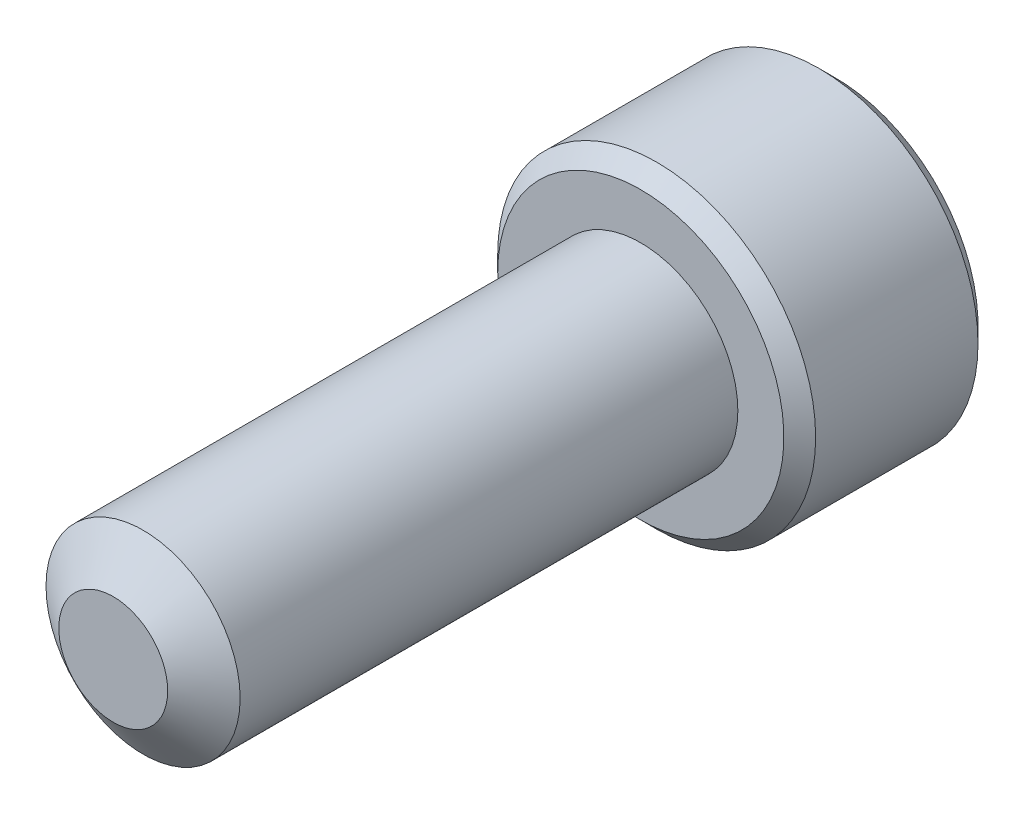
ISO-10303-21;
HEADER;
FILE_DESCRIPTION(('STEP AP214'),'2;1');
FILE_NAME('part.step','',(''),(''),'','','');
FILE_SCHEMA(('AUTOMOTIVE_DESIGN { 1 0 10303 214 1 1 1 1 }'));
ENDSEC;
DATA;
#1=APPLICATION_CONTEXT('core data for automotive mechanical design processes');
#2=APPLICATION_PROTOCOL_DEFINITION('international standard','automotive_design',2000,#1);
#3=PRODUCT_CONTEXT('',#1,'mechanical');
#4=PRODUCT('Part','Part','',(#3));
#5=PRODUCT_RELATED_PRODUCT_CATEGORY('part','',(#4));
#6=PRODUCT_DEFINITION_FORMATION('','',#4);
#7=PRODUCT_DEFINITION_CONTEXT('part definition',#1,'design');
#8=PRODUCT_DEFINITION('design','',#6,#7);
#9=PRODUCT_DEFINITION_SHAPE('','',#8);
#10=(LENGTH_UNIT() NAMED_UNIT(*) SI_UNIT(.MILLI.,.METRE.));
#11=(NAMED_UNIT(*) PLANE_ANGLE_UNIT() SI_UNIT($,.RADIAN.));
#12=(NAMED_UNIT(*) SI_UNIT($,.STERADIAN.) SOLID_ANGLE_UNIT());
#13=UNCERTAINTY_MEASURE_WITH_UNIT(LENGTH_MEASURE(1.E-05),#10,'distance_accuracy_value','');
#14=(GEOMETRIC_REPRESENTATION_CONTEXT(3) GLOBAL_UNCERTAINTY_ASSIGNED_CONTEXT((#13)) GLOBAL_UNIT_ASSIGNED_CONTEXT((#10,
#11,#12)) REPRESENTATION_CONTEXT('',''));
#15=CARTESIAN_POINT('',(0.,0.,0.));
#16=DIRECTION('',(0.,0.,1.));
#17=DIRECTION('',(1.,0.,0.));
#18=AXIS2_PLACEMENT_3D('',#15,#16,#17);
#19=CARTESIAN_POINT('',(0.,0.,-9.525));
#20=DIRECTION('',(0.,0.,1.));
#21=DIRECTION('',(1.,0.,0.));
#22=AXIS2_PLACEMENT_3D('',#19,#20,#21);
#23=CYLINDRICAL_SURFACE('',#22,1.7526);
#24=CARTESIAN_POINT('',(0.,0.,-9.525));
#25=DIRECTION('',(0.,0.,-1.));
#26=DIRECTION('',(-1.,0.,0.));
#27=AXIS2_PLACEMENT_3D('',#24,#25,#26);
#28=CIRCLE('',#27,1.7526);
#29=CARTESIAN_POINT('',(1.7526,0.,-9.525));
#30=VERTEX_POINT('',#29);
#31=EDGE_CURVE('E214',#30,#30,#28,.F.);
#32=CARTESIAN_POINT('',(0.,0.,-0.538848735955547));
#33=DIRECTION('',(0.,0.,1.));
#34=DIRECTION('',(1.,0.,0.));
#35=AXIS2_PLACEMENT_3D('',#32,#33,#34);
#36=CIRCLE('',#35,1.7526);
#37=CARTESIAN_POINT('',(1.7526,0.,-0.538848735955548));
#38=VERTEX_POINT('',#37);
#39=EDGE_CURVE('E108',#38,#38,#36,.T.);
#40=CARTESIAN_POINT('',(1.7526,0.,-9.525));
#41=CARTESIAN_POINT('',(1.7526,0.,-9.4313942576662));
#42=CARTESIAN_POINT('',(1.7526,0.,-9.33778851533241));
#43=CARTESIAN_POINT('',(1.7526,0.,-9.15057703066481));
#44=CARTESIAN_POINT('',(1.7526,0.,-9.05697128833102));
#45=CARTESIAN_POINT('',(1.7526,0.,-8.86975980366342));
#46=CARTESIAN_POINT('',(1.7526,0.,-8.77615406132963));
#47=CARTESIAN_POINT('',(1.7526,0.,-8.58894257666203));
#48=CARTESIAN_POINT('',(1.7526,0.,-8.49533683432824));
#49=CARTESIAN_POINT('',(1.7526,0.,-8.30812534966065));
#50=CARTESIAN_POINT('',(1.7526,0.,-8.21451960732685));
#51=CARTESIAN_POINT('',(1.7526,0.,-8.02730812265926));
#52=CARTESIAN_POINT('',(1.7526,0.,-7.93370238032546));
#53=CARTESIAN_POINT('',(1.7526,0.,-7.74649089565787));
#54=CARTESIAN_POINT('',(1.7526,0.,-7.65288515332407));
#55=CARTESIAN_POINT('',(1.7526,0.,-7.46567366865648));
#56=CARTESIAN_POINT('',(1.7526,0.,-7.37206792632268));
#57=CARTESIAN_POINT('',(1.7526,0.,-7.18485644165509));
#58=CARTESIAN_POINT('',(1.7526,0.,-7.09125069932129));
#59=CARTESIAN_POINT('',(1.7526,0.,-6.9040392146537));
#60=CARTESIAN_POINT('',(1.7526,0.,-6.8104334723199));
#61=CARTESIAN_POINT('',(1.7526,0.,-6.62322198765231));
#62=CARTESIAN_POINT('',(1.7526,0.,-6.52961624531851));
#63=CARTESIAN_POINT('',(1.7526,0.,-6.34240476065092));
#64=CARTESIAN_POINT('',(1.7526,0.,-6.24879901831713));
#65=CARTESIAN_POINT('',(1.7526,0.,-6.06158753364953));
#66=CARTESIAN_POINT('',(1.7526,0.,-5.96798179131574));
#67=CARTESIAN_POINT('',(1.7526,0.,-5.78077030664814));
#68=CARTESIAN_POINT('',(1.7526,0.,-5.68716456431435));
#69=CARTESIAN_POINT('',(1.7526,0.,-5.49995307964676));
#70=CARTESIAN_POINT('',(1.7526,0.,-5.40634733731296));
#71=CARTESIAN_POINT('',(1.7526,0.,-5.21913585264537));
#72=CARTESIAN_POINT('',(1.7526,0.,-5.12553011031157));
#73=CARTESIAN_POINT('',(1.7526,0.,-4.93831862564398));
#74=CARTESIAN_POINT('',(1.7526,0.,-4.84471288331018));
#75=CARTESIAN_POINT('',(1.7526,0.,-4.65750139864259));
#76=CARTESIAN_POINT('',(1.7526,0.,-4.56389565630879));
#77=CARTESIAN_POINT('',(1.7526,0.,-4.3766841716412));
#78=CARTESIAN_POINT('',(1.7526,0.,-4.2830784293074));
#79=CARTESIAN_POINT('',(1.7526,0.,-4.09586694463981));
#80=CARTESIAN_POINT('',(1.7526,0.,-4.00226120230601));
#81=CARTESIAN_POINT('',(1.7526,0.,-3.81504971763842));
#82=CARTESIAN_POINT('',(1.7526,0.,-3.72144397530462));
#83=CARTESIAN_POINT('',(1.7526,0.,-3.53423249063703));
#84=CARTESIAN_POINT('',(1.7526,0.,-3.44062674830323));
#85=CARTESIAN_POINT('',(1.7526,0.,-3.25341526363564));
#86=CARTESIAN_POINT('',(1.7526,0.,-3.15980952130185));
#87=CARTESIAN_POINT('',(1.7526,0.,-2.97259803663425));
#88=CARTESIAN_POINT('',(1.7526,0.,-2.87899229430046));
#89=CARTESIAN_POINT('',(1.7526,0.,-2.69178080963286));
#90=CARTESIAN_POINT('',(1.7526,0.,-2.59817506729907));
#91=CARTESIAN_POINT('',(1.7526,0.,-2.41096358263147));
#92=CARTESIAN_POINT('',(1.7526,0.,-2.31735784029768));
#93=CARTESIAN_POINT('',(1.7526,0.,-2.13014635563009));
#94=CARTESIAN_POINT('',(1.7526,0.,-2.03654061329629));
#95=CARTESIAN_POINT('',(1.7526,0.,-1.8493291286287));
#96=CARTESIAN_POINT('',(1.7526,0.,-1.7557233862949));
#97=CARTESIAN_POINT('',(1.7526,0.,-1.56851190162731));
#98=CARTESIAN_POINT('',(1.7526,0.,-1.47490615929351));
#99=CARTESIAN_POINT('',(1.7526,0.,-1.28769467462592));
#100=CARTESIAN_POINT('',(1.7526,0.,-1.19408893229212));
#101=CARTESIAN_POINT('',(1.7526,0.,-1.00687744762453));
#102=CARTESIAN_POINT('',(1.7526,0.,-0.913271705290733));
#103=CARTESIAN_POINT('',(1.7526,0.,-0.726060220623141));
#104=CARTESIAN_POINT('',(1.7526,0.,-0.632454478289344));
#105=CARTESIAN_POINT('',(1.7526,0.,-0.538848735955548));
#106=B_SPLINE_CURVE_WITH_KNOTS('',3,(#40,#41,#42,#43,#44,#45,#46,#47,#48,#49,#50,#51,#52,#53,
#54,#55,#56,#57,#58,#59,#60,#61,#62,#63,#64,#65,#66,#67,#68,#69,#70,#71,#72,#73,#74,#75,#76,#77,
#78,#79,#80,#81,#82,#83,#84,#85,#86,#87,#88,#89,#90,#91,#92,#93,#94,#95,#96,#97,#98,#99,#100,
#101,#102,#103,#104,#105),.UNSPECIFIED.,.F.,.F.,(4,2,2,2,2,2,2,2,2,2,2,2,2,2,2,2,2,2,2,2,2,2,2,
2,2,2,2,2,2,2,2,2,4),(0.,0.280817227001391,0.56163445400278,0.842451681004169,1.12326890800556,
1.40408613500695,1.68490336200834,1.96572058900973,2.24653781601111,2.5273550430125,
2.80817227001389,3.08898949701528,3.36980672401667,3.65062395101806,3.93144117801945,
4.21225840502084,4.49307563202223,4.77389285902362,5.054710086025,5.33552731302639,
5.61634454002778,5.89716176702917,6.17797899403056,6.45879622103195,6.73961344803334,
7.02043067503473,7.30124790203612,7.58206512903751,7.8628823560389,8.14369958304029,
8.42451681004168,8.70533403704306,8.98615126404445),.UNSPECIFIED.);
#107=EDGE_CURVE('BSEAM34',#30,#38,#106,.T.);
#108=ORIENTED_EDGE('',*,*,#31,.T.);
#109=ORIENTED_EDGE('',*,*,#39,.F.);
#110=ORIENTED_EDGE('',*,*,#107,.T.);
#111=ORIENTED_EDGE('',*,*,#107,.F.);
#112=EDGE_LOOP('',(#108,#110,#109,#111));
#113=FACE_BOUND('',#112,.T.);
#114=ADVANCED_FACE('F34',(#113),#23,.T.);
#115=CARTESIAN_POINT('',(0.,0.,0.));
#116=DIRECTION('',(0.,0.,-1.));
#117=DIRECTION('',(-1.,0.,0.));
#118=AXIS2_PLACEMENT_3D('',#115,#116,#117);
#119=CONICAL_SURFACE('',#118,0.983044251809573,0.959931088596884);
#120=ORIENTED_EDGE('',*,*,#39,.T.);
#121=EDGE_LOOP('',(#120));
#122=FACE_BOUND('',#121,.T.);
#123=CARTESIAN_POINT('',(0.,0.,0.));
#124=DIRECTION('',(0.,0.,1.));
#125=DIRECTION('',(1.,0.,0.));
#126=AXIS2_PLACEMENT_3D('',#123,#124,#125);
#127=CIRCLE('',#126,0.983044251809573);
#128=CARTESIAN_POINT('',(0.983044251809573,0.,0.));
#129=VERTEX_POINT('',#128);
#130=EDGE_CURVE('E212',#129,#129,#127,.T.);
#131=ORIENTED_EDGE('',*,*,#130,.F.);
#132=EDGE_LOOP('',(#131));
#133=FACE_BOUND('',#132,.T.);
#134=ADVANCED_FACE('F195',(#122,#133),#119,.T.);
#135=CARTESIAN_POINT('',(0.,0.,0.));
#136=DIRECTION('',(0.,0.,1.));
#137=DIRECTION('',(1.,0.,0.));
#138=AXIS2_PLACEMENT_3D('',#135,#136,#137);
#139=PLANE('',#138);
#140=ORIENTED_EDGE('',*,*,#130,.T.);
#141=EDGE_LOOP('',(#140));
#142=FACE_BOUND('',#141,.T.);
#143=ADVANCED_FACE('F192',(#142),#139,.T.);
#144=CARTESIAN_POINT('',(0.,0.,-13.0302));
#145=DIRECTION('',(0.,0.,1.));
#146=DIRECTION('',(1.,0.,0.));
#147=AXIS2_PLACEMENT_3D('',#144,#145,#146);
#148=CYLINDRICAL_SURFACE('',#147,2.8702);
#149=CARTESIAN_POINT('',(0.,0.,-12.74318));
#150=DIRECTION('',(0.,0.,-1.));
#151=DIRECTION('',(-1.,0.,0.));
#152=AXIS2_PLACEMENT_3D('',#149,#150,#151);
#153=CIRCLE('',#152,2.8702);
#154=CARTESIAN_POINT('',(-2.8702,0.,-12.74318));
#155=VERTEX_POINT('',#154);
#156=EDGE_CURVE('E42',#155,#155,#153,.F.);
#157=ORIENTED_EDGE('',*,*,#156,.T.);
#158=EDGE_LOOP('',(#157));
#159=FACE_BOUND('',#158,.T.);
#160=CARTESIAN_POINT('',(0.,0.,-9.81202));
#161=DIRECTION('',(0.,0.,-1.));
#162=DIRECTION('',(-1.,0.,0.));
#163=AXIS2_PLACEMENT_3D('',#160,#161,#162);
#164=CIRCLE('',#163,2.8702);
#165=CARTESIAN_POINT('',(-2.8702,0.,-9.81202));
#166=VERTEX_POINT('',#165);
#167=EDGE_CURVE('E171',#166,#166,#164,.T.);
#168=ORIENTED_EDGE('',*,*,#167,.T.);
#169=EDGE_LOOP('',(#168));
#170=FACE_BOUND('',#169,.T.);
#171=ADVANCED_FACE('F176',(#159,#170),#148,.T.);
#172=CARTESIAN_POINT('',(0.,0.,-13.0302));
#173=DIRECTION('',(0.,0.,-1.));
#174=DIRECTION('',(-1.,0.,0.));
#175=AXIS2_PLACEMENT_3D('',#172,#173,#174);
#176=PLANE('',#175);
#177=CARTESIAN_POINT('',(0.,0.,-13.0302));
#178=DIRECTION('',(0.,0.,-1.));
#179=DIRECTION('',(-1.,0.,0.));
#180=AXIS2_PLACEMENT_3D('',#177,#178,#179);
#181=CIRCLE('',#180,2.58317999999999);
#182=CARTESIAN_POINT('',(-2.58317999999999,0.,-13.0302));
#183=VERTEX_POINT('',#182);
#184=EDGE_CURVE('E107',#183,#183,#181,.T.);
#185=ORIENTED_EDGE('',*,*,#184,.T.);
#186=EDGE_LOOP('',(#185));
#187=FACE_BOUND('',#186,.T.);
#188=CARTESIAN_POINT('',(0.,0.,-13.0302));
#189=DIRECTION('',(0.,0.,-1.));
#190=DIRECTION('',(-1.,0.,0.));
#191=AXIS2_PLACEMENT_3D('',#188,#189,#190);
#192=CIRCLE('',#191,1.60395121659243);
#193=CARTESIAN_POINT('',(-1.3890625,0.801975608296215,-13.0302));
#194=VERTEX_POINT('',#193);
#195=CARTESIAN_POINT('',(0.,1.60395121659243,-13.0302));
#196=VERTEX_POINT('',#195);
#197=EDGE_CURVE('E88',#194,#196,#192,.T.);
#198=ORIENTED_EDGE('',*,*,#197,.F.);
#199=CARTESIAN_POINT('',(-1.3890625,-0.801975608296215,-13.0302));
#200=VERTEX_POINT('',#199);
#201=EDGE_CURVE('E48',#200,#194,#192,.T.);
#202=ORIENTED_EDGE('',*,*,#201,.F.);
#203=CARTESIAN_POINT('',(0.,-1.60395121659243,-13.0302));
#204=VERTEX_POINT('',#203);
#205=EDGE_CURVE('E273',#204,#200,#192,.T.);
#206=ORIENTED_EDGE('',*,*,#205,.F.);
#207=CARTESIAN_POINT('',(1.3890625,-0.801975608296215,-13.0302));
#208=VERTEX_POINT('',#207);
#209=EDGE_CURVE('E55',#208,#204,#192,.T.);
#210=ORIENTED_EDGE('',*,*,#209,.F.);
#211=CARTESIAN_POINT('',(1.3890625,0.801975608296215,-13.0302));
#212=VERTEX_POINT('',#211);
#213=EDGE_CURVE('E129',#212,#208,#192,.T.);
#214=ORIENTED_EDGE('',*,*,#213,.F.);
#215=EDGE_CURVE('E97',#196,#212,#192,.T.);
#216=ORIENTED_EDGE('',*,*,#215,.F.);
#217=EDGE_LOOP('',(#198,#202,#206,#210,#214,#216));
#218=FACE_BOUND('',#217,.T.);
#219=ADVANCED_FACE('F128',(#187,#218),#176,.T.);
#220=CARTESIAN_POINT('',(0.,0.,-9.525));
#221=DIRECTION('',(0.,0.,-1.));
#222=DIRECTION('',(-1.,0.,0.));
#223=AXIS2_PLACEMENT_3D('',#220,#221,#222);
#224=PLANE('',#223);
#225=CARTESIAN_POINT('',(0.,0.,-9.525));
#226=DIRECTION('',(0.,0.,-1.));
#227=DIRECTION('',(-1.,0.,0.));
#228=AXIS2_PLACEMENT_3D('',#225,#226,#227);
#229=CIRCLE('',#228,2.58318);
#230=CARTESIAN_POINT('',(-2.58318,0.,-9.525));
#231=VERTEX_POINT('',#230);
#232=EDGE_CURVE('E11',#231,#231,#229,.F.);
#233=ORIENTED_EDGE('',*,*,#232,.T.);
#234=EDGE_LOOP('',(#233));
#235=FACE_BOUND('',#234,.T.);
#236=ORIENTED_EDGE('',*,*,#31,.F.);
#237=EDGE_LOOP('',(#236));
#238=FACE_BOUND('',#237,.T.);
#239=ADVANCED_FACE('F185',(#235,#238),#224,.F.);
#240=CARTESIAN_POINT('',(0.,0.,-13.0302));
#241=DIRECTION('',(0.,0.,-1.));
#242=DIRECTION('',(-1.,0.,0.));
#243=AXIS2_PLACEMENT_3D('',#240,#241,#242);
#244=CONICAL_SURFACE('',#243,1.60395121659243,0.78539816339745);
#245=ORIENTED_EDGE('',*,*,#215,.T.);
#246=CARTESIAN_POINT('',(-0.000199999999999852,1.60406668664627,-13.0303154825221));
#247=CARTESIAN_POINT('',(0.0475548148995861,1.57649543140889,-13.0027647868811));
#248=CARTESIAN_POINT('',(0.0961082129767679,1.54846311395896,-12.9768319141145));
#249=CARTESIAN_POINT('',(0.195114281423185,1.49130193369001,-12.9293489608708));
#250=CARTESIAN_POINT('',(0.245576372730142,1.46216763169007,-12.9078253080794));
#251=CARTESIAN_POINT('',(0.34733083528491,1.40341966534283,-12.8709546019866));
#252=CARTESIAN_POINT('',(0.398597278416376,1.37382097060048,-12.8555148513149));
#253=CARTESIAN_POINT('',(0.502259069123939,1.31397180783079,-12.8317264581829));
#254=CARTESIAN_POINT('',(0.554651247789434,1.28372316937484,-12.8233600517165));
#255=CARTESIAN_POINT('',(0.644944084544836,1.23159257576821,-12.8158113663708));
#256=CARTESIAN_POINT('',(0.682728034255603,1.20977800223165,-12.8146936971037));
#257=CARTESIAN_POINT('',(0.758229287800439,1.16618733317339,-12.8165750513552));
#258=CARTESIAN_POINT('',(0.79594657508652,1.14441124720567,-12.8195749834252));
#259=CARTESIAN_POINT('',(0.871018018906522,1.10106872890773,-12.8295189567457));
#260=CARTESIAN_POINT('',(0.908371804329555,1.07950251083849,-12.8364666704902));
#261=CARTESIAN_POINT('',(0.982452435596042,1.03673203843505,-12.8539288810594));
#262=CARTESIAN_POINT('',(1.01917900521513,1.01552794357906,-12.8644449088769));
#263=CARTESIAN_POINT('',(1.11325413716704,0.961213640822576,-12.8956664203823));
#264=CARTESIAN_POINT('',(1.17001916310317,0.928440337817793,-12.9187263608604));
#265=CARTESIAN_POINT('',(1.25348479270274,0.880251434100402,-12.9576547118295));
#266=CARTESIAN_POINT('',(1.28098915116073,0.86437178534079,-12.9713318145832));
#267=CARTESIAN_POINT('',(1.33549195495674,0.832904576897576,-12.9999348081189));
#268=CARTESIAN_POINT('',(1.36249063449213,0.817316882000055,-13.0148601023926));
#269=CARTESIAN_POINT('',(1.3892625,0.801860138242377,-13.0303154825221));
#270=B_SPLINE_CURVE_WITH_KNOTS('',3,(#246,#247,#248,#249,#250,#251,#252,#253,#254,#255,#256,
#257,#258,#259,#260,#261,#262,#263,#264,#265,#266,#267,#268,#269),.UNSPECIFIED.,.F.,.F.,(4,2,2,
2,2,2,2,2,2,2,2,4),(0.,0.185054161583332,0.371186974731966,0.554362620151554,0.737076859824674,
0.867821902366108,0.998595798526819,1.12949154907137,1.26044353188444,1.46846066168042,
1.57218026599103,1.67585058309997),.UNSPECIFIED.);
#271=EDGE_CURVE('E102',#196,#212,#270,.T.);
#272=ORIENTED_EDGE('',*,*,#271,.F.);
#273=EDGE_LOOP('',(#245,#272));
#274=FACE_BOUND('',#273,.T.);
#275=ADVANCED_FACE('F103',(#274),#244,.F.);
#276=ORIENTED_EDGE('',*,*,#213,.T.);
#277=CARTESIAN_POINT('',(1.3890625,-1.59946669533747,-13.5446888553473));
#278=CARTESIAN_POINT('',(1.3890625,-1.56052074100157,-13.5152883204447));
#279=CARTESIAN_POINT('',(1.3890625,-1.52135778101398,-13.4861760571059));
#280=CARTESIAN_POINT('',(1.3890625,-1.44250974368035,-13.4286471018554));
#281=CARTESIAN_POINT('',(1.3890625,-1.40282453775616,-13.4002305863579));
#282=CARTESIAN_POINT('',(1.3890625,-1.28227261747607,-13.3157979106091));
#283=CARTESIAN_POINT('',(1.3890625,-1.20050167441145,-13.2610513931364));
#284=CARTESIAN_POINT('',(1.3890625,-1.0290311937974,-13.1535774539605));
#285=CARTESIAN_POINT('',(1.3890625,-0.939145510476103,-13.1011436435155));
#286=CARTESIAN_POINT('',(1.3890625,-0.754884542278012,-13.0052310286316));
#287=CARTESIAN_POINT('',(1.3890625,-0.660525767721076,-12.9617220353823));
#288=CARTESIAN_POINT('',(1.3890625,-0.518892422901336,-12.9084928148428));
#289=CARTESIAN_POINT('',(1.3890625,-0.473714746794419,-12.8932156455446));
#290=CARTESIAN_POINT('',(1.3890625,-0.382268722235191,-12.8662883218985));
#291=CARTESIAN_POINT('',(1.3890625,-0.336000298881662,-12.8546384174186));
#292=CARTESIAN_POINT('',(1.3890625,-0.243422308835822,-12.8357647672582));
#293=CARTESIAN_POINT('',(1.3890625,-0.197128447486238,-12.8284651868372));
#294=CARTESIAN_POINT('',(1.3890625,-0.104045636784198,-12.818434703163));
#295=CARTESIAN_POINT('',(1.3890625,-0.0572567739284931,-12.8157030145629));
#296=CARTESIAN_POINT('',(1.3890625,0.0346588401718091,-12.8150109514094));
#297=CARTESIAN_POINT('',(1.3890625,0.0797843745088175,-12.8168812460884));
#298=CARTESIAN_POINT('',(1.3890625,0.169653022605208,-12.8249168656859));
#299=CARTESIAN_POINT('',(1.3890625,0.214396061393213,-12.8310830139257));
#300=CARTESIAN_POINT('',(1.3890625,0.303926740576741,-12.8474783142406));
#301=CARTESIAN_POINT('',(1.3890625,0.348701560562637,-12.8577764230037));
#302=CARTESIAN_POINT('',(1.3890625,0.437272889801829,-12.8818883282635));
#303=CARTESIAN_POINT('',(1.3890625,0.481069480580726,-12.8957018305893));
#304=CARTESIAN_POINT('',(1.3890625,0.618958177531063,-12.9443885558667));
#305=CARTESIAN_POINT('',(1.3890625,0.711087679809601,-12.9848066296314));
#306=CARTESIAN_POINT('',(1.3890625,0.891018647016391,-13.0746712938188));
#307=CARTESIAN_POINT('',(1.3890625,0.978803075143675,-13.1241503209353));
#308=CARTESIAN_POINT('',(1.3890625,1.14657176186197,-13.2262299189673));
#309=CARTESIAN_POINT('',(1.3890625,1.22672686003424,-13.2785531888122));
#310=CARTESIAN_POINT('',(1.3890625,1.34481925924245,-13.3594395512885));
#311=CARTESIAN_POINT('',(1.3890625,1.38367371461019,-13.3866868720938));
#312=CARTESIAN_POINT('',(1.3890625,1.46085170378017,-13.4419021635328));
#313=CARTESIAN_POINT('',(1.3890625,1.49917537967343,-13.4698699353332));
#314=CARTESIAN_POINT('',(1.3890625,1.53727804285926,-13.4981364275532));
#315=B_SPLINE_CURVE_WITH_KNOTS('',3,(#277,#278,#279,#280,#281,#282,#283,#284,#285,#286,#287,
#288,#289,#290,#291,#292,#293,#294,#295,#296,#297,#298,#299,#300,#301,#302,#303,#304,#305,#306,
#307,#308,#309,#310,#311,#312,#313,#314),.UNSPECIFIED.,.F.,.F.,(4,2,2,2,2,2,2,2,2,2,2,2,2,2,2,2,
2,2,4),(0.,0.146388252251747,0.292813246205363,0.587897938676557,0.899825715593295,
1.21068031322194,1.35363178607714,1.49659310411811,1.6369833143961,1.77734938523477,
1.91262840625218,2.04793336128669,2.18559709790565,2.32324931849741,2.62418012481466,
2.92621005486572,3.2132312503121,3.35559422447357,3.49791832091463),.UNSPECIFIED.);
#316=EDGE_CURVE('E96',#212,#208,#315,.F.);
#317=ORIENTED_EDGE('',*,*,#316,.F.);
#318=EDGE_LOOP('',(#276,#317));
#319=FACE_BOUND('',#318,.T.);
#320=ADVANCED_FACE('F279',(#319),#244,.F.);
#321=ORIENTED_EDGE('',*,*,#209,.T.);
#322=CARTESIAN_POINT('',(1.3892625,-0.801860138242377,-13.0303154825221));
#323=CARTESIAN_POINT('',(1.34150768510041,-0.829431393479753,-13.0027647868811));
#324=CARTESIAN_POINT('',(1.29295428702323,-0.857463710929685,-12.9768319141145));
#325=CARTESIAN_POINT('',(1.19394821857682,-0.914624891198631,-12.9293489608708));
#326=CARTESIAN_POINT('',(1.14348612726986,-0.943759193198574,-12.9078253080794));
#327=CARTESIAN_POINT('',(1.04173166471509,-1.00250715954582,-12.8709546019866));
#328=CARTESIAN_POINT('',(0.990465221583624,-1.03210585428816,-12.8555148513149));
#329=CARTESIAN_POINT('',(0.886803430876061,-1.09195501705785,-12.8317264581829));
#330=CARTESIAN_POINT('',(0.834411252210567,-1.12220365551381,-12.8233600517165));
#331=CARTESIAN_POINT('',(0.744118415455164,-1.17433424912043,-12.8158113663708));
#332=CARTESIAN_POINT('',(0.706334465744398,-1.19614882265699,-12.8146936971037));
#333=CARTESIAN_POINT('',(0.630833212199561,-1.23973949171526,-12.8165750513552));
#334=CARTESIAN_POINT('',(0.59311592491348,-1.26151557768298,-12.8195749834252));
#335=CARTESIAN_POINT('',(0.518044481093478,-1.30485809598091,-12.8295189567457));
#336=CARTESIAN_POINT('',(0.480690695670445,-1.32642431405015,-12.8364666704902));
#337=CARTESIAN_POINT('',(0.406610064403958,-1.36919478645359,-12.8539288810594));
#338=CARTESIAN_POINT('',(0.36988349478487,-1.39039888130958,-12.8644449088769));
#339=CARTESIAN_POINT('',(0.275808362832965,-1.44471318406607,-12.8956664203823));
#340=CARTESIAN_POINT('',(0.219043336896831,-1.47748648707085,-12.9187263608604));
#341=CARTESIAN_POINT('',(0.135577707297264,-1.52567539078824,-12.9576547118295));
#342=CARTESIAN_POINT('',(0.108073348839268,-1.54155503954785,-12.9713318145832));
#343=CARTESIAN_POINT('',(0.0535705450432614,-1.57302224799107,-12.9999348081189));
#344=CARTESIAN_POINT('',(0.0265718655078731,-1.58860994288859,-13.0148601023926));
#345=CARTESIAN_POINT('',(-0.000199999999999538,-1.60406668664627,-13.0303154825221));
#346=B_SPLINE_CURVE_WITH_KNOTS('',3,(#322,#323,#324,#325,#326,#327,#328,#329,#330,#331,#332,
#333,#334,#335,#336,#337,#338,#339,#340,#341,#342,#343,#344,#345),.UNSPECIFIED.,.F.,.F.,(4,2,2,
2,2,2,2,2,2,2,2,4),(0.,0.185054161583332,0.371186974731966,0.554362620151553,0.737076859824674,
0.867821902366108,0.998595798526819,1.12949154907136,1.26044353188444,1.46846066168042,
1.57218026599103,1.67585058309997),.UNSPECIFIED.);
#347=EDGE_CURVE('E139',#208,#204,#346,.T.);
#348=ORIENTED_EDGE('',*,*,#347,.F.);
#349=EDGE_LOOP('',(#321,#348));
#350=FACE_BOUND('',#349,.T.);
#351=ADVANCED_FACE('F276',(#350),#244,.F.);
#352=ORIENTED_EDGE('',*,*,#205,.T.);
#353=CARTESIAN_POINT('',(0.000200000000000236,-1.60406668664627,-13.0303154825221));
#354=CARTESIAN_POINT('',(-0.0475548148995862,-1.57649543140889,-13.0027647868811));
#355=CARTESIAN_POINT('',(-0.0961082129767681,-1.54846311395896,-12.9768319141145));
#356=CARTESIAN_POINT('',(-0.195114281423185,-1.49130193369001,-12.9293489608708));
#357=CARTESIAN_POINT('',(-0.245576372730141,-1.46216763169007,-12.9078253080794));
#358=CARTESIAN_POINT('',(-0.34733083528491,-1.40341966534283,-12.8709546019866));
#359=CARTESIAN_POINT('',(-0.398597278416377,-1.37382097060048,-12.8555148513149));
#360=CARTESIAN_POINT('',(-0.50225906912394,-1.31397180783079,-12.8317264581829));
#361=CARTESIAN_POINT('',(-0.554651247789434,-1.28372316937484,-12.8233600517165));
#362=CARTESIAN_POINT('',(-0.644944084544836,-1.23159257576821,-12.8158113663708));
#363=CARTESIAN_POINT('',(-0.682728034255602,-1.20977800223165,-12.8146936971037));
#364=CARTESIAN_POINT('',(-0.758229287800439,-1.16618733317339,-12.8165750513552));
#365=CARTESIAN_POINT('',(-0.79594657508652,-1.14441124720567,-12.8195749834252));
#366=CARTESIAN_POINT('',(-0.871018018906522,-1.10106872890773,-12.8295189567457));
#367=CARTESIAN_POINT('',(-0.908371804329555,-1.07950251083849,-12.8364666704902));
#368=CARTESIAN_POINT('',(-0.982452435596042,-1.03673203843505,-12.8539288810594));
#369=CARTESIAN_POINT('',(-1.01917900521513,-1.01552794357906,-12.8644449088769));
#370=CARTESIAN_POINT('',(-1.11325413716704,-0.961213640822576,-12.8956664203823));
#371=CARTESIAN_POINT('',(-1.17001916310317,-0.928440337817793,-12.9187263608604));
#372=CARTESIAN_POINT('',(-1.25348479270274,-0.880251434100401,-12.9576547118295));
#373=CARTESIAN_POINT('',(-1.28098915116073,-0.864371785340789,-12.9713318145832));
#374=CARTESIAN_POINT('',(-1.33549195495674,-0.832904576897576,-12.9999348081189));
#375=CARTESIAN_POINT('',(-1.36249063449213,-0.817316882000055,-13.0148601023926));
#376=CARTESIAN_POINT('',(-1.3892625,-0.801860138242377,-13.0303154825221));
#377=B_SPLINE_CURVE_WITH_KNOTS('',3,(#353,#354,#355,#356,#357,#358,#359,#360,#361,#362,#363,
#364,#365,#366,#367,#368,#369,#370,#371,#372,#373,#374,#375,#376),.UNSPECIFIED.,.F.,.F.,(4,2,2,
2,2,2,2,2,2,2,2,4),(0.,0.185054161583333,0.371186974731967,0.554362620151555,0.737076859824674,
0.867821902366108,0.998595798526819,1.12949154907137,1.26044353188444,1.46846066168042,
1.57218026599104,1.67585058309997),.UNSPECIFIED.);
#378=EDGE_CURVE('E250',#204,#200,#377,.T.);
#379=ORIENTED_EDGE('',*,*,#378,.F.);
#380=EDGE_LOOP('',(#352,#379));
#381=FACE_BOUND('',#380,.T.);
#382=ADVANCED_FACE('F275',(#381),#244,.F.);
#383=ORIENTED_EDGE('',*,*,#201,.T.);
#384=CARTESIAN_POINT('',(-1.3890625,-1.59946669533747,-13.5446888553473));
#385=CARTESIAN_POINT('',(-1.3890625,-1.56052074100157,-13.5152883204447));
#386=CARTESIAN_POINT('',(-1.3890625,-1.52135778101398,-13.4861760571059));
#387=CARTESIAN_POINT('',(-1.3890625,-1.44250974368035,-13.4286471018554));
#388=CARTESIAN_POINT('',(-1.3890625,-1.40282453775616,-13.4002305863579));
#389=CARTESIAN_POINT('',(-1.3890625,-1.28227261747607,-13.3157979106091));
#390=CARTESIAN_POINT('',(-1.3890625,-1.20050167441145,-13.2610513931364));
#391=CARTESIAN_POINT('',(-1.3890625,-1.0290311937974,-13.1535774539605));
#392=CARTESIAN_POINT('',(-1.3890625,-0.939145510476104,-13.1011436435155));
#393=CARTESIAN_POINT('',(-1.3890625,-0.754884542278013,-13.0052310286316));
#394=CARTESIAN_POINT('',(-1.3890625,-0.660525767721077,-12.9617220353823));
#395=CARTESIAN_POINT('',(-1.3890625,-0.518892422901336,-12.9084928148428));
#396=CARTESIAN_POINT('',(-1.3890625,-0.47371474679442,-12.8932156455446));
#397=CARTESIAN_POINT('',(-1.3890625,-0.382268722235192,-12.8662883218985));
#398=CARTESIAN_POINT('',(-1.3890625,-0.336000298881663,-12.8546384174186));
#399=CARTESIAN_POINT('',(-1.3890625,-0.243422308835823,-12.8357647672582));
#400=CARTESIAN_POINT('',(-1.3890625,-0.197128447486238,-12.8284651868372));
#401=CARTESIAN_POINT('',(-1.3890625,-0.104045636784197,-12.818434703163));
#402=CARTESIAN_POINT('',(-1.3890625,-0.0572567739284927,-12.8157030145629));
#403=CARTESIAN_POINT('',(-1.3890625,0.0346588401718097,-12.8150109514094));
#404=CARTESIAN_POINT('',(-1.3890625,0.0797843745088182,-12.8168812460884));
#405=CARTESIAN_POINT('',(-1.3890625,0.169653022605209,-12.8249168656859));
#406=CARTESIAN_POINT('',(-1.3890625,0.214396061393213,-12.8310830139257));
#407=CARTESIAN_POINT('',(-1.3890625,0.303926740576742,-12.8474783142406));
#408=CARTESIAN_POINT('',(-1.3890625,0.348701560562638,-12.8577764230037));
#409=CARTESIAN_POINT('',(-1.3890625,0.437272889801829,-12.8818883282635));
#410=CARTESIAN_POINT('',(-1.3890625,0.481069480580726,-12.8957018305893));
#411=CARTESIAN_POINT('',(-1.3890625,0.618958177531064,-12.9443885558667));
#412=CARTESIAN_POINT('',(-1.3890625,0.711087679809601,-12.9848066296314));
#413=CARTESIAN_POINT('',(-1.3890625,0.891018647016392,-13.0746712938188));
#414=CARTESIAN_POINT('',(-1.3890625,0.978803075143675,-13.1241503209353));
#415=CARTESIAN_POINT('',(-1.3890625,1.14657176186197,-13.2262299189673));
#416=CARTESIAN_POINT('',(-1.3890625,1.22672686003424,-13.2785531888122));
#417=CARTESIAN_POINT('',(-1.3890625,1.34481925924245,-13.3594395512885));
#418=CARTESIAN_POINT('',(-1.3890625,1.3836737146102,-13.3866868720938));
#419=CARTESIAN_POINT('',(-1.3890625,1.46085170378018,-13.4419021635328));
#420=CARTESIAN_POINT('',(-1.3890625,1.49917537967343,-13.4698699353332));
#421=CARTESIAN_POINT('',(-1.3890625,1.53727804285926,-13.4981364275532));
#422=B_SPLINE_CURVE_WITH_KNOTS('',3,(#384,#385,#386,#387,#388,#389,#390,#391,#392,#393,#394,
#395,#396,#397,#398,#399,#400,#401,#402,#403,#404,#405,#406,#407,#408,#409,#410,#411,#412,#413,
#414,#415,#416,#417,#418,#419,#420,#421),.UNSPECIFIED.,.F.,.F.,(4,2,2,2,2,2,2,2,2,2,2,2,2,2,2,2,
2,2,4),(0.,0.146388252251748,0.292813246205363,0.587897938676555,0.899825715593293,
1.21068031322194,1.35363178607713,1.49659310411811,1.63698331439609,1.77734938523477,
1.91262840625218,2.04793336128669,2.18559709790565,2.32324931849741,2.62418012481466,
2.92621005486572,3.2132312503121,3.35559422447357,3.49791832091463),.UNSPECIFIED.);
#423=EDGE_CURVE('E118',#200,#194,#422,.T.);
#424=ORIENTED_EDGE('',*,*,#423,.F.);
#425=EDGE_LOOP('',(#383,#424));
#426=FACE_BOUND('',#425,.T.);
#427=ADVANCED_FACE('F288',(#426),#244,.F.);
#428=ORIENTED_EDGE('',*,*,#197,.T.);
#429=CARTESIAN_POINT('',(-1.3892625,0.801860138242377,-13.0303154825221));
#430=CARTESIAN_POINT('',(-1.34150768510041,0.829431393479753,-13.0027647868811));
#431=CARTESIAN_POINT('',(-1.29295428702323,0.857463710929685,-12.9768319141145));
#432=CARTESIAN_POINT('',(-1.19394821857682,0.91462489119863,-12.9293489608708));
#433=CARTESIAN_POINT('',(-1.14348612726986,0.943759193198573,-12.9078253080794));
#434=CARTESIAN_POINT('',(-1.04173166471509,1.00250715954581,-12.8709546019866));
#435=CARTESIAN_POINT('',(-0.990465221583624,1.03210585428816,-12.8555148513149));
#436=CARTESIAN_POINT('',(-0.886803430876061,1.09195501705785,-12.8317264581829));
#437=CARTESIAN_POINT('',(-0.834411252210567,1.12220365551381,-12.8233600517165));
#438=CARTESIAN_POINT('',(-0.744118415455164,1.17433424912043,-12.8158113663708));
#439=CARTESIAN_POINT('',(-0.706334465744398,1.19614882265699,-12.8146936971037));
#440=CARTESIAN_POINT('',(-0.630833212199562,1.23973949171526,-12.8165750513552));
#441=CARTESIAN_POINT('',(-0.593115924913481,1.26151557768298,-12.8195749834252));
#442=CARTESIAN_POINT('',(-0.518044481093479,1.30485809598091,-12.8295189567457));
#443=CARTESIAN_POINT('',(-0.480690695670446,1.32642431405015,-12.8364666704902));
#444=CARTESIAN_POINT('',(-0.406610064403959,1.36919478645359,-12.8539288810594));
#445=CARTESIAN_POINT('',(-0.369883494784871,1.39039888130958,-12.8644449088769));
#446=CARTESIAN_POINT('',(-0.275808362832965,1.44471318406607,-12.8956664203823));
#447=CARTESIAN_POINT('',(-0.219043336896831,1.47748648707085,-12.9187263608604));
#448=CARTESIAN_POINT('',(-0.135577707297263,1.52567539078824,-12.9576547118295));
#449=CARTESIAN_POINT('',(-0.108073348839267,1.54155503954785,-12.9713318145832));
#450=CARTESIAN_POINT('',(-0.0535705450432611,1.57302224799107,-12.9999348081189));
#451=CARTESIAN_POINT('',(-0.0265718655078729,1.58860994288859,-13.0148601023926));
#452=CARTESIAN_POINT('',(0.000199999999999726,1.60406668664627,-13.0303154825221));
#453=B_SPLINE_CURVE_WITH_KNOTS('',3,(#429,#430,#431,#432,#433,#434,#435,#436,#437,#438,#439,
#440,#441,#442,#443,#444,#445,#446,#447,#448,#449,#450,#451,#452),.UNSPECIFIED.,.F.,.F.,(4,2,2,
2,2,2,2,2,2,2,2,4),(0.,0.185054161583332,0.371186974731965,0.554362620151553,0.737076859824673,
0.867821902366107,0.998595798526818,1.12949154907136,1.26044353188444,1.46846066168042,
1.57218026599103,1.67585058309997),.UNSPECIFIED.);
#454=EDGE_CURVE('E92',#194,#196,#453,.T.);
#455=ORIENTED_EDGE('',*,*,#454,.F.);
#456=EDGE_LOOP('',(#428,#455));
#457=FACE_BOUND('',#456,.T.);
#458=ADVANCED_FACE('F90',(#457),#244,.F.);
#459=CARTESIAN_POINT('',(1.3890625,2.40592682488864,-10.94660625));
#460=DIRECTION('',(0.,0.,-1.));
#461=DIRECTION('',(-1.,0.,0.));
#462=AXIS2_PLACEMENT_3D('',#459,#460,#461);
#463=PLANE('',#462);
#464=DIRECTION('',(0.866025403784439,0.5,0.));
#465=VECTOR('',#464,1.);
#466=CARTESIAN_POINT('',(-1.3890625,0.801975608296215,-10.94660625));
#467=LINE('',#466,#465);
#468=CARTESIAN_POINT('',(-1.3890625,0.801975608296215,-10.94660625));
#469=VERTEX_POINT('',#468);
#470=CARTESIAN_POINT('',(0.,1.60395121659243,-10.94660625));
#471=VERTEX_POINT('',#470);
#472=EDGE_CURVE('E117',#469,#471,#467,.T.);
#473=ORIENTED_EDGE('',*,*,#472,.T.);
#474=DIRECTION('',(0.866025403784439,-0.5,0.));
#475=VECTOR('',#474,1.);
#476=CARTESIAN_POINT('',(0.,1.60395121659243,-10.94660625));
#477=LINE('',#476,#475);
#478=CARTESIAN_POINT('',(1.3890625,0.801975608296215,-10.94660625));
#479=VERTEX_POINT('',#478);
#480=EDGE_CURVE('E122',#471,#479,#477,.T.);
#481=ORIENTED_EDGE('',*,*,#480,.T.);
#482=DIRECTION('',(0.,-1.,0.));
#483=VECTOR('',#482,1.);
#484=CARTESIAN_POINT('',(1.3890625,0.801975608296215,-10.94660625));
#485=LINE('',#484,#483);
#486=CARTESIAN_POINT('',(1.3890625,-0.801975608296215,-10.94660625));
#487=VERTEX_POINT('',#486);
#488=EDGE_CURVE('E236',#479,#487,#485,.T.);
#489=ORIENTED_EDGE('',*,*,#488,.T.);
#490=DIRECTION('',(-0.866025403784438,-0.5,0.));
#491=VECTOR('',#490,1.);
#492=CARTESIAN_POINT('',(1.3890625,-0.801975608296215,-10.94660625));
#493=LINE('',#492,#491);
#494=CARTESIAN_POINT('',(0.,-1.60395121659243,-10.94660625));
#495=VERTEX_POINT('',#494);
#496=EDGE_CURVE('E233',#487,#495,#493,.T.);
#497=ORIENTED_EDGE('',*,*,#496,.T.);
#498=DIRECTION('',(-0.866025403784439,0.5,0.));
#499=VECTOR('',#498,1.);
#500=CARTESIAN_POINT('',(0.,-1.60395121659243,-10.94660625));
#501=LINE('',#500,#499);
#502=CARTESIAN_POINT('',(-1.3890625,-0.801975608296215,-10.94660625));
#503=VERTEX_POINT('',#502);
#504=EDGE_CURVE('E230',#495,#503,#501,.T.);
#505=ORIENTED_EDGE('',*,*,#504,.T.);
#506=DIRECTION('',(0.,1.,0.));
#507=VECTOR('',#506,1.);
#508=CARTESIAN_POINT('',(-1.3890625,-0.801975608296215,-10.94660625));
#509=LINE('',#508,#507);
#510=EDGE_CURVE('E125',#503,#469,#509,.T.);
#511=ORIENTED_EDGE('',*,*,#510,.T.);
#512=EDGE_LOOP('',(#473,#481,#489,#497,#505,#511));
#513=FACE_BOUND('',#512,.T.);
#514=ADVANCED_FACE('F159',(#513),#463,.T.);
#515=CARTESIAN_POINT('',(0.,1.60395121659243,-10.94660625));
#516=DIRECTION('',(0.5,0.866025403784439,0.));
#517=DIRECTION('',(-0.866025403784439,0.5,0.));
#518=AXIS2_PLACEMENT_3D('',#515,#516,#517);
#519=PLANE('',#518);
#520=DIRECTION('',(0.,0.,-1.));
#521=VECTOR('',#520,1.);
#522=CARTESIAN_POINT('',(0.,1.60395121659243,-10.94660625));
#523=LINE('',#522,#521);
#524=EDGE_CURVE('E114',#471,#196,#523,.T.);
#525=ORIENTED_EDGE('',*,*,#524,.T.);
#526=ORIENTED_EDGE('',*,*,#271,.T.);
#527=DIRECTION('',(0.,0.,-1.));
#528=VECTOR('',#527,1.);
#529=CARTESIAN_POINT('',(1.3890625,0.801975608296215,-10.94660625));
#530=LINE('',#529,#528);
#531=EDGE_CURVE('E124',#479,#212,#530,.T.);
#532=ORIENTED_EDGE('',*,*,#531,.F.);
#533=ORIENTED_EDGE('',*,*,#480,.F.);
#534=EDGE_LOOP('',(#525,#526,#532,#533));
#535=FACE_BOUND('',#534,.T.);
#536=ADVANCED_FACE('F120',(#535),#519,.F.);
#537=CARTESIAN_POINT('',(1.3890625,0.801975608296215,-10.94660625));
#538=DIRECTION('',(1.,0.,0.));
#539=DIRECTION('',(0.,1.,0.));
#540=AXIS2_PLACEMENT_3D('',#537,#538,#539);
#541=PLANE('',#540);
#542=ORIENTED_EDGE('',*,*,#531,.T.);
#543=ORIENTED_EDGE('',*,*,#316,.T.);
#544=DIRECTION('',(0.,0.,-1.));
#545=VECTOR('',#544,1.);
#546=CARTESIAN_POINT('',(1.3890625,-0.801975608296215,-10.94660625));
#547=LINE('',#546,#545);
#548=EDGE_CURVE('E219',#487,#208,#547,.T.);
#549=ORIENTED_EDGE('',*,*,#548,.F.);
#550=ORIENTED_EDGE('',*,*,#488,.F.);
#551=EDGE_LOOP('',(#542,#543,#549,#550));
#552=FACE_BOUND('',#551,.T.);
#553=ADVANCED_FACE('F148',(#552),#541,.F.);
#554=CARTESIAN_POINT('',(1.3890625,-0.801975608296215,-10.94660625));
#555=DIRECTION('',(0.5,-0.866025403784439,0.));
#556=DIRECTION('',(0.866025403784438,0.5,0.));
#557=AXIS2_PLACEMENT_3D('',#554,#555,#556);
#558=PLANE('',#557);
#559=ORIENTED_EDGE('',*,*,#548,.T.);
#560=ORIENTED_EDGE('',*,*,#347,.T.);
#561=DIRECTION('',(0.,0.,-1.));
#562=VECTOR('',#561,1.);
#563=CARTESIAN_POINT('',(0.,-1.60395121659243,-10.94660625));
#564=LINE('',#563,#562);
#565=EDGE_CURVE('E222',#495,#204,#564,.T.);
#566=ORIENTED_EDGE('',*,*,#565,.F.);
#567=ORIENTED_EDGE('',*,*,#496,.F.);
#568=EDGE_LOOP('',(#559,#560,#566,#567));
#569=FACE_BOUND('',#568,.T.);
#570=ADVANCED_FACE('F152',(#569),#558,.F.);
#571=CARTESIAN_POINT('',(0.,-1.60395121659243,-10.94660625));
#572=DIRECTION('',(-0.5,-0.866025403784439,0.));
#573=DIRECTION('',(0.866025403784439,-0.5,0.));
#574=AXIS2_PLACEMENT_3D('',#571,#572,#573);
#575=PLANE('',#574);
#576=ORIENTED_EDGE('',*,*,#565,.T.);
#577=ORIENTED_EDGE('',*,*,#378,.T.);
#578=DIRECTION('',(0.,0.,-1.));
#579=VECTOR('',#578,1.);
#580=CARTESIAN_POINT('',(-1.3890625,-0.801975608296215,-10.94660625));
#581=LINE('',#580,#579);
#582=EDGE_CURVE('E225',#503,#200,#581,.T.);
#583=ORIENTED_EDGE('',*,*,#582,.F.);
#584=ORIENTED_EDGE('',*,*,#504,.F.);
#585=EDGE_LOOP('',(#576,#577,#583,#584));
#586=FACE_BOUND('',#585,.T.);
#587=ADVANCED_FACE('F258',(#586),#575,.F.);
#588=CARTESIAN_POINT('',(-1.3890625,-0.801975608296215,-10.94660625));
#589=DIRECTION('',(-1.,0.,0.));
#590=DIRECTION('',(0.,-1.,0.));
#591=AXIS2_PLACEMENT_3D('',#588,#589,#590);
#592=PLANE('',#591);
#593=ORIENTED_EDGE('',*,*,#582,.T.);
#594=ORIENTED_EDGE('',*,*,#423,.T.);
#595=DIRECTION('',(0.,0.,-1.));
#596=VECTOR('',#595,1.);
#597=CARTESIAN_POINT('',(-1.3890625,0.801975608296215,-10.94660625));
#598=LINE('',#597,#596);
#599=EDGE_CURVE('E116',#469,#194,#598,.T.);
#600=ORIENTED_EDGE('',*,*,#599,.F.);
#601=ORIENTED_EDGE('',*,*,#510,.F.);
#602=EDGE_LOOP('',(#593,#594,#600,#601));
#603=FACE_BOUND('',#602,.T.);
#604=ADVANCED_FACE('F255',(#603),#592,.F.);
#605=CARTESIAN_POINT('',(-1.3890625,0.801975608296215,-10.94660625));
#606=DIRECTION('',(-0.5,0.866025403784439,0.));
#607=DIRECTION('',(-0.866025403784439,-0.5,0.));
#608=AXIS2_PLACEMENT_3D('',#605,#606,#607);
#609=PLANE('',#608);
#610=ORIENTED_EDGE('',*,*,#599,.T.);
#611=ORIENTED_EDGE('',*,*,#454,.T.);
#612=ORIENTED_EDGE('',*,*,#524,.F.);
#613=ORIENTED_EDGE('',*,*,#472,.F.);
#614=EDGE_LOOP('',(#610,#611,#612,#613));
#615=FACE_BOUND('',#614,.T.);
#616=ADVANCED_FACE('F112',(#615),#609,.F.);
#617=CARTESIAN_POINT('',(0.,0.,-13.0302));
#618=DIRECTION('',(0.,0.,1.));
#619=DIRECTION('',(1.,0.,0.));
#620=AXIS2_PLACEMENT_3D('',#617,#618,#619);
#621=CONICAL_SURFACE('',#620,2.58317999999999,0.785398163397445);
#622=ORIENTED_EDGE('',*,*,#156,.F.);
#623=EDGE_LOOP('',(#622));
#624=FACE_BOUND('',#623,.T.);
#625=ORIENTED_EDGE('',*,*,#184,.F.);
#626=EDGE_LOOP('',(#625));
#627=FACE_BOUND('',#626,.T.);
#628=ADVANCED_FACE('F179',(#624,#627),#621,.T.);
#629=CARTESIAN_POINT('',(0.,0.,-9.81202));
#630=DIRECTION('',(0.,0.,-1.));
#631=DIRECTION('',(-1.,0.,0.));
#632=AXIS2_PLACEMENT_3D('',#629,#630,#631);
#633=CONICAL_SURFACE('',#632,2.8702,0.785398163397452);
#634=ORIENTED_EDGE('',*,*,#232,.F.);
#635=EDGE_LOOP('',(#634));
#636=FACE_BOUND('',#635,.T.);
#637=ORIENTED_EDGE('',*,*,#167,.F.);
#638=EDGE_LOOP('',(#637));
#639=FACE_BOUND('',#638,.T.);
#640=ADVANCED_FACE('F36',(#636,#639),#633,.T.);
#641=CLOSED_SHELL('',(#114,#134,#143,#171,#219,#239,#275,#320,#351,#382,#427,#458,#514,#536,
#553,#570,#587,#604,#616,#628,#640));
#642=MANIFOLD_SOLID_BREP('B2',#641);
#643=ADVANCED_BREP_SHAPE_REPRESENTATION('',(#18,#642),#14);
#644=SHAPE_DEFINITION_REPRESENTATION(#9,#643);
ENDSEC;
END-ISO-10303-21;
